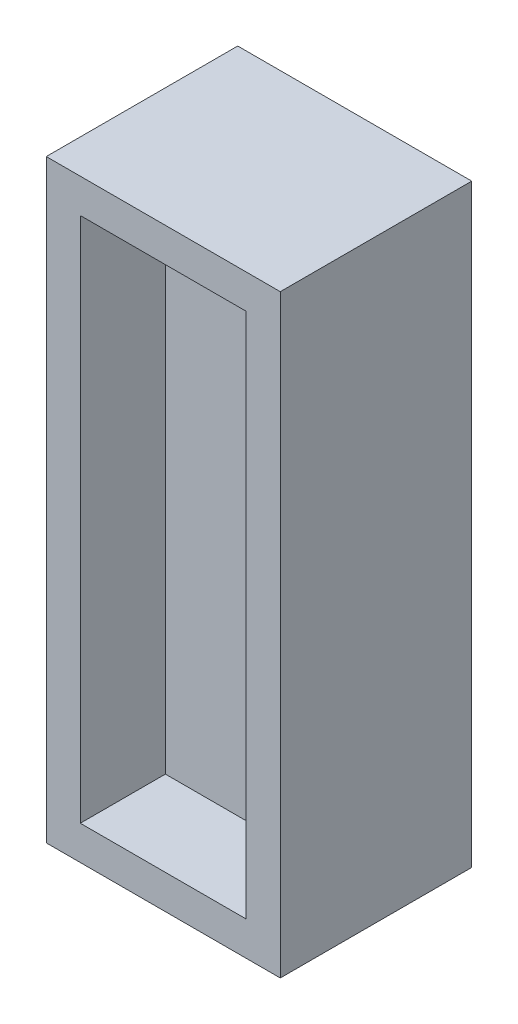
ISO-10303-21;
HEADER;
FILE_DESCRIPTION(('STEP AP214'),'2;1');
FILE_NAME('part.step','',(''),(''),'','','');
FILE_SCHEMA(('AUTOMOTIVE_DESIGN { 1 0 10303 214 1 1 1 1 }'));
ENDSEC;
DATA;
#1=APPLICATION_CONTEXT('core data for automotive mechanical design processes');
#2=APPLICATION_PROTOCOL_DEFINITION('international standard','automotive_design',2000,#1);
#3=PRODUCT_CONTEXT('',#1,'mechanical');
#4=PRODUCT('Part','Part','',(#3));
#5=PRODUCT_RELATED_PRODUCT_CATEGORY('part','',(#4));
#6=PRODUCT_DEFINITION_FORMATION('','',#4);
#7=PRODUCT_DEFINITION_CONTEXT('part definition',#1,'design');
#8=PRODUCT_DEFINITION('design','',#6,#7);
#9=PRODUCT_DEFINITION_SHAPE('','',#8);
#10=(LENGTH_UNIT() NAMED_UNIT(*) SI_UNIT(.MILLI.,.METRE.));
#11=(NAMED_UNIT(*) PLANE_ANGLE_UNIT() SI_UNIT($,.RADIAN.));
#12=(NAMED_UNIT(*) SI_UNIT($,.STERADIAN.) SOLID_ANGLE_UNIT());
#13=UNCERTAINTY_MEASURE_WITH_UNIT(LENGTH_MEASURE(1.E-05),#10,'distance_accuracy_value','');
#14=(GEOMETRIC_REPRESENTATION_CONTEXT(3) GLOBAL_UNCERTAINTY_ASSIGNED_CONTEXT((#13)) GLOBAL_UNIT_ASSIGNED_CONTEXT((#10,
#11,#12)) REPRESENTATION_CONTEXT('',''));
#15=CARTESIAN_POINT('',(0.,0.,0.));
#16=DIRECTION('',(0.,0.,1.));
#17=DIRECTION('',(1.,0.,0.));
#18=AXIS2_PLACEMENT_3D('',#15,#16,#17);
#19=CARTESIAN_POINT('',(-27.5,-69.85,45.));
#20=DIRECTION('',(1.,0.,0.));
#21=DIRECTION('',(0.,0.,-1.));
#22=AXIS2_PLACEMENT_3D('',#19,#20,#21);
#23=PLANE('',#22);
#24=DIRECTION('',(0.,-1.,0.));
#25=VECTOR('',#24,1.);
#26=CARTESIAN_POINT('',(-27.5,-69.85,0.));
#27=LINE('',#26,#25);
#28=CARTESIAN_POINT('',(-27.5,69.85,0.));
#29=VERTEX_POINT('',#28);
#30=CARTESIAN_POINT('',(-27.5,-69.85,0.));
#31=VERTEX_POINT('',#30);
#32=EDGE_CURVE('E141',#29,#31,#27,.T.);
#33=ORIENTED_EDGE('',*,*,#32,.T.);
#34=DIRECTION('',(0.,0.,-1.));
#35=VECTOR('',#34,1.);
#36=CARTESIAN_POINT('',(-27.5,-69.85,45.));
#37=LINE('',#36,#35);
#38=CARTESIAN_POINT('',(-27.5,-69.85,45.));
#39=VERTEX_POINT('',#38);
#40=EDGE_CURVE('E11',#39,#31,#37,.T.);
#41=ORIENTED_EDGE('',*,*,#40,.F.);
#42=DIRECTION('',(0.,-1.,0.));
#43=VECTOR('',#42,1.);
#44=CARTESIAN_POINT('',(-27.5,-69.85,45.));
#45=LINE('',#44,#43);
#46=CARTESIAN_POINT('',(-27.5,69.85,45.));
#47=VERTEX_POINT('',#46);
#48=EDGE_CURVE('E145',#47,#39,#45,.T.);
#49=ORIENTED_EDGE('',*,*,#48,.F.);
#50=DIRECTION('',(0.,0.,-1.));
#51=VECTOR('',#50,1.);
#52=CARTESIAN_POINT('',(-27.5,69.85,45.));
#53=LINE('',#52,#51);
#54=EDGE_CURVE('E151',#47,#29,#53,.T.);
#55=ORIENTED_EDGE('',*,*,#54,.T.);
#56=EDGE_LOOP('',(#33,#41,#49,#55));
#57=FACE_BOUND('',#56,.T.);
#58=ADVANCED_FACE('F33',(#57),#23,.F.);
#59=CARTESIAN_POINT('',(27.5,-69.85,45.));
#60=DIRECTION('',(0.,1.,0.));
#61=DIRECTION('',(-1.,0.,0.));
#62=AXIS2_PLACEMENT_3D('',#59,#60,#61);
#63=PLANE('',#62);
#64=DIRECTION('',(1.,0.,0.));
#65=VECTOR('',#64,1.);
#66=CARTESIAN_POINT('',(27.5,-69.85,0.));
#67=LINE('',#66,#65);
#68=CARTESIAN_POINT('',(27.5,-69.85,0.));
#69=VERTEX_POINT('',#68);
#70=EDGE_CURVE('E154',#31,#69,#67,.T.);
#71=ORIENTED_EDGE('',*,*,#70,.T.);
#72=DIRECTION('',(0.,0.,-1.));
#73=VECTOR('',#72,1.);
#74=CARTESIAN_POINT('',(27.5,-69.85,45.));
#75=LINE('',#74,#73);
#76=CARTESIAN_POINT('',(27.5,-69.85,45.));
#77=VERTEX_POINT('',#76);
#78=EDGE_CURVE('E40',#77,#69,#75,.T.);
#79=ORIENTED_EDGE('',*,*,#78,.F.);
#80=DIRECTION('',(1.,0.,0.));
#81=VECTOR('',#80,1.);
#82=CARTESIAN_POINT('',(27.5,-69.85,45.));
#83=LINE('',#82,#81);
#84=EDGE_CURVE('E84',#39,#77,#83,.T.);
#85=ORIENTED_EDGE('',*,*,#84,.F.);
#86=ORIENTED_EDGE('',*,*,#40,.T.);
#87=EDGE_LOOP('',(#71,#79,#85,#86));
#88=FACE_BOUND('',#87,.T.);
#89=ADVANCED_FACE('F183',(#88),#63,.F.);
#90=CARTESIAN_POINT('',(27.5,-69.85,45.));
#91=DIRECTION('',(-1.,0.,0.));
#92=DIRECTION('',(0.,0.,1.));
#93=AXIS2_PLACEMENT_3D('',#90,#91,#92);
#94=PLANE('',#93);
#95=DIRECTION('',(0.,1.,0.));
#96=VECTOR('',#95,1.);
#97=CARTESIAN_POINT('',(27.5,-69.85,0.));
#98=LINE('',#97,#96);
#99=CARTESIAN_POINT('',(27.5,69.85,0.));
#100=VERTEX_POINT('',#99);
#101=EDGE_CURVE('E156',#69,#100,#98,.T.);
#102=ORIENTED_EDGE('',*,*,#101,.T.);
#103=DIRECTION('',(0.,0.,-1.));
#104=VECTOR('',#103,1.);
#105=CARTESIAN_POINT('',(27.5,69.85,45.));
#106=LINE('',#105,#104);
#107=CARTESIAN_POINT('',(27.5,69.85,45.));
#108=VERTEX_POINT('',#107);
#109=EDGE_CURVE('E160',#108,#100,#106,.T.);
#110=ORIENTED_EDGE('',*,*,#109,.F.);
#111=DIRECTION('',(0.,1.,0.));
#112=VECTOR('',#111,1.);
#113=CARTESIAN_POINT('',(27.5,-69.85,45.));
#114=LINE('',#113,#112);
#115=EDGE_CURVE('E148',#77,#108,#114,.T.);
#116=ORIENTED_EDGE('',*,*,#115,.F.);
#117=ORIENTED_EDGE('',*,*,#78,.T.);
#118=EDGE_LOOP('',(#102,#110,#116,#117));
#119=FACE_BOUND('',#118,.T.);
#120=ADVANCED_FACE('F165',(#119),#94,.F.);
#121=CARTESIAN_POINT('',(27.5,69.85,45.));
#122=DIRECTION('',(0.,-1.,0.));
#123=DIRECTION('',(1.,0.,0.));
#124=AXIS2_PLACEMENT_3D('',#121,#122,#123);
#125=PLANE('',#124);
#126=DIRECTION('',(-1.,0.,0.));
#127=VECTOR('',#126,1.);
#128=CARTESIAN_POINT('',(27.5,69.85,0.));
#129=LINE('',#128,#127);
#130=EDGE_CURVE('E77',#100,#29,#129,.T.);
#131=ORIENTED_EDGE('',*,*,#130,.T.);
#132=ORIENTED_EDGE('',*,*,#54,.F.);
#133=DIRECTION('',(-1.,0.,0.));
#134=VECTOR('',#133,1.);
#135=CARTESIAN_POINT('',(27.5,69.85,45.));
#136=LINE('',#135,#134);
#137=EDGE_CURVE('E56',#108,#47,#136,.T.);
#138=ORIENTED_EDGE('',*,*,#137,.F.);
#139=ORIENTED_EDGE('',*,*,#109,.T.);
#140=EDGE_LOOP('',(#131,#132,#138,#139));
#141=FACE_BOUND('',#140,.T.);
#142=ADVANCED_FACE('F173',(#141),#125,.F.);
#143=CARTESIAN_POINT('',(-27.5,69.85,45.));
#144=DIRECTION('',(0.,0.,1.));
#145=DIRECTION('',(1.,0.,0.));
#146=AXIS2_PLACEMENT_3D('',#143,#144,#145);
#147=PLANE('',#146);
#148=DIRECTION('',(0.,1.,0.));
#149=VECTOR('',#148,1.);
#150=CARTESIAN_POINT('',(19.5,-61.85,45.));
#151=LINE('',#150,#149);
#152=CARTESIAN_POINT('',(19.5,-61.85,45.));
#153=VERTEX_POINT('',#152);
#154=CARTESIAN_POINT('',(19.5,61.85,45.));
#155=VERTEX_POINT('',#154);
#156=EDGE_CURVE('E47',#153,#155,#151,.T.);
#157=ORIENTED_EDGE('',*,*,#156,.F.);
#158=DIRECTION('',(1.,0.,0.));
#159=VECTOR('',#158,1.);
#160=CARTESIAN_POINT('',(-19.5,-61.85,45.));
#161=LINE('',#160,#159);
#162=CARTESIAN_POINT('',(-19.5,-61.85,45.));
#163=VERTEX_POINT('',#162);
#164=EDGE_CURVE('E126',#163,#153,#161,.T.);
#165=ORIENTED_EDGE('',*,*,#164,.F.);
#166=DIRECTION('',(0.,-1.,0.));
#167=VECTOR('',#166,1.);
#168=CARTESIAN_POINT('',(-19.5,-61.85,45.));
#169=LINE('',#168,#167);
#170=CARTESIAN_POINT('',(-19.5,61.85,45.));
#171=VERTEX_POINT('',#170);
#172=EDGE_CURVE('E129',#171,#163,#169,.T.);
#173=ORIENTED_EDGE('',*,*,#172,.F.);
#174=DIRECTION('',(-1.,0.,0.));
#175=VECTOR('',#174,1.);
#176=CARTESIAN_POINT('',(-19.5,61.85,45.));
#177=LINE('',#176,#175);
#178=EDGE_CURVE('E135',#155,#171,#177,.T.);
#179=ORIENTED_EDGE('',*,*,#178,.F.);
#180=EDGE_LOOP('',(#157,#165,#173,#179));
#181=FACE_BOUND('',#180,.T.);
#182=ORIENTED_EDGE('',*,*,#48,.T.);
#183=ORIENTED_EDGE('',*,*,#84,.T.);
#184=ORIENTED_EDGE('',*,*,#115,.T.);
#185=ORIENTED_EDGE('',*,*,#137,.T.);
#186=EDGE_LOOP('',(#182,#183,#184,#185));
#187=FACE_BOUND('',#186,.T.);
#188=ADVANCED_FACE('F175',(#181,#187),#147,.T.);
#189=CARTESIAN_POINT('',(-27.5,69.85,0.));
#190=DIRECTION('',(0.,0.,1.));
#191=DIRECTION('',(1.,0.,0.));
#192=AXIS2_PLACEMENT_3D('',#189,#190,#191);
#193=PLANE('',#192);
#194=ORIENTED_EDGE('',*,*,#32,.F.);
#195=ORIENTED_EDGE('',*,*,#130,.F.);
#196=ORIENTED_EDGE('',*,*,#101,.F.);
#197=ORIENTED_EDGE('',*,*,#70,.F.);
#198=EDGE_LOOP('',(#194,#195,#196,#197));
#199=FACE_BOUND('',#198,.T.);
#200=ADVANCED_FACE('F169',(#199),#193,.F.);
#201=CARTESIAN_POINT('',(19.5,-61.85,25.));
#202=DIRECTION('',(1.,0.,0.));
#203=DIRECTION('',(0.,0.,-1.));
#204=AXIS2_PLACEMENT_3D('',#201,#202,#203);
#205=PLANE('',#204);
#206=ORIENTED_EDGE('',*,*,#156,.T.);
#207=DIRECTION('',(0.,0.,1.));
#208=VECTOR('',#207,1.);
#209=CARTESIAN_POINT('',(19.5,61.85,25.));
#210=LINE('',#209,#208);
#211=CARTESIAN_POINT('',(19.5,61.85,25.));
#212=VERTEX_POINT('',#211);
#213=EDGE_CURVE('E104',#212,#155,#210,.T.);
#214=ORIENTED_EDGE('',*,*,#213,.F.);
#215=DIRECTION('',(0.,1.,0.));
#216=VECTOR('',#215,1.);
#217=CARTESIAN_POINT('',(19.5,-61.85,25.));
#218=LINE('',#217,#216);
#219=CARTESIAN_POINT('',(19.5,-61.85,25.));
#220=VERTEX_POINT('',#219);
#221=EDGE_CURVE('E108',#220,#212,#218,.T.);
#222=ORIENTED_EDGE('',*,*,#221,.F.);
#223=DIRECTION('',(0.,0.,1.));
#224=VECTOR('',#223,1.);
#225=CARTESIAN_POINT('',(19.5,-61.85,25.));
#226=LINE('',#225,#224);
#227=EDGE_CURVE('E139',#220,#153,#226,.T.);
#228=ORIENTED_EDGE('',*,*,#227,.T.);
#229=EDGE_LOOP('',(#206,#214,#222,#228));
#230=FACE_BOUND('',#229,.T.);
#231=ADVANCED_FACE('F106',(#230),#205,.F.);
#232=CARTESIAN_POINT('',(-19.5,-61.85,25.));
#233=DIRECTION('',(0.,-1.,0.));
#234=DIRECTION('',(0.,0.,-1.));
#235=AXIS2_PLACEMENT_3D('',#232,#233,#234);
#236=PLANE('',#235);
#237=ORIENTED_EDGE('',*,*,#164,.T.);
#238=ORIENTED_EDGE('',*,*,#227,.F.);
#239=DIRECTION('',(1.,0.,0.));
#240=VECTOR('',#239,1.);
#241=CARTESIAN_POINT('',(-19.5,-61.85,25.));
#242=LINE('',#241,#240);
#243=CARTESIAN_POINT('',(-19.5,-61.85,25.));
#244=VERTEX_POINT('',#243);
#245=EDGE_CURVE('E114',#244,#220,#242,.T.);
#246=ORIENTED_EDGE('',*,*,#245,.F.);
#247=DIRECTION('',(0.,0.,1.));
#248=VECTOR('',#247,1.);
#249=CARTESIAN_POINT('',(-19.5,-61.85,25.));
#250=LINE('',#249,#248);
#251=EDGE_CURVE('E142',#244,#163,#250,.T.);
#252=ORIENTED_EDGE('',*,*,#251,.T.);
#253=EDGE_LOOP('',(#237,#238,#246,#252));
#254=FACE_BOUND('',#253,.T.);
#255=ADVANCED_FACE('F222',(#254),#236,.F.);
#256=CARTESIAN_POINT('',(-19.5,-61.85,25.));
#257=DIRECTION('',(-1.,0.,0.));
#258=DIRECTION('',(0.,0.,1.));
#259=AXIS2_PLACEMENT_3D('',#256,#257,#258);
#260=PLANE('',#259);
#261=ORIENTED_EDGE('',*,*,#172,.T.);
#262=ORIENTED_EDGE('',*,*,#251,.F.);
#263=DIRECTION('',(0.,-1.,0.));
#264=VECTOR('',#263,1.);
#265=CARTESIAN_POINT('',(-19.5,-61.85,25.));
#266=LINE('',#265,#264);
#267=CARTESIAN_POINT('',(-19.5,61.85,25.));
#268=VERTEX_POINT('',#267);
#269=EDGE_CURVE('E122',#268,#244,#266,.T.);
#270=ORIENTED_EDGE('',*,*,#269,.F.);
#271=DIRECTION('',(0.,0.,1.));
#272=VECTOR('',#271,1.);
#273=CARTESIAN_POINT('',(-19.5,61.85,25.));
#274=LINE('',#273,#272);
#275=EDGE_CURVE('E113',#268,#171,#274,.T.);
#276=ORIENTED_EDGE('',*,*,#275,.T.);
#277=EDGE_LOOP('',(#261,#262,#270,#276));
#278=FACE_BOUND('',#277,.T.);
#279=ADVANCED_FACE('F231',(#278),#260,.F.);
#280=CARTESIAN_POINT('',(-19.5,61.85,25.));
#281=DIRECTION('',(0.,1.,0.));
#282=DIRECTION('',(0.,0.,1.));
#283=AXIS2_PLACEMENT_3D('',#280,#281,#282);
#284=PLANE('',#283);
#285=ORIENTED_EDGE('',*,*,#178,.T.);
#286=ORIENTED_EDGE('',*,*,#275,.F.);
#287=DIRECTION('',(-1.,0.,0.));
#288=VECTOR('',#287,1.);
#289=CARTESIAN_POINT('',(-19.5,61.85,25.));
#290=LINE('',#289,#288);
#291=EDGE_CURVE('E117',#212,#268,#290,.T.);
#292=ORIENTED_EDGE('',*,*,#291,.F.);
#293=ORIENTED_EDGE('',*,*,#213,.T.);
#294=EDGE_LOOP('',(#285,#286,#292,#293));
#295=FACE_BOUND('',#294,.T.);
#296=ADVANCED_FACE('F118',(#295),#284,.F.);
#297=CARTESIAN_POINT('',(19.5,61.85,25.));
#298=DIRECTION('',(0.,0.,-1.));
#299=DIRECTION('',(-1.,0.,0.));
#300=AXIS2_PLACEMENT_3D('',#297,#298,#299);
#301=PLANE('',#300);
#302=ORIENTED_EDGE('',*,*,#221,.T.);
#303=ORIENTED_EDGE('',*,*,#291,.T.);
#304=ORIENTED_EDGE('',*,*,#269,.T.);
#305=ORIENTED_EDGE('',*,*,#245,.T.);
#306=EDGE_LOOP('',(#302,#303,#304,#305));
#307=FACE_BOUND('',#306,.T.);
#308=ADVANCED_FACE('F124',(#307),#301,.F.);
#309=CLOSED_SHELL('',(#58,#89,#120,#142,#188,#200,#231,#255,#279,#296,#308));
#310=MANIFOLD_SOLID_BREP('B2',#309);
#311=ADVANCED_BREP_SHAPE_REPRESENTATION('',(#18,#310),#14);
#312=SHAPE_DEFINITION_REPRESENTATION(#9,#311);
ENDSEC;
END-ISO-10303-21;
